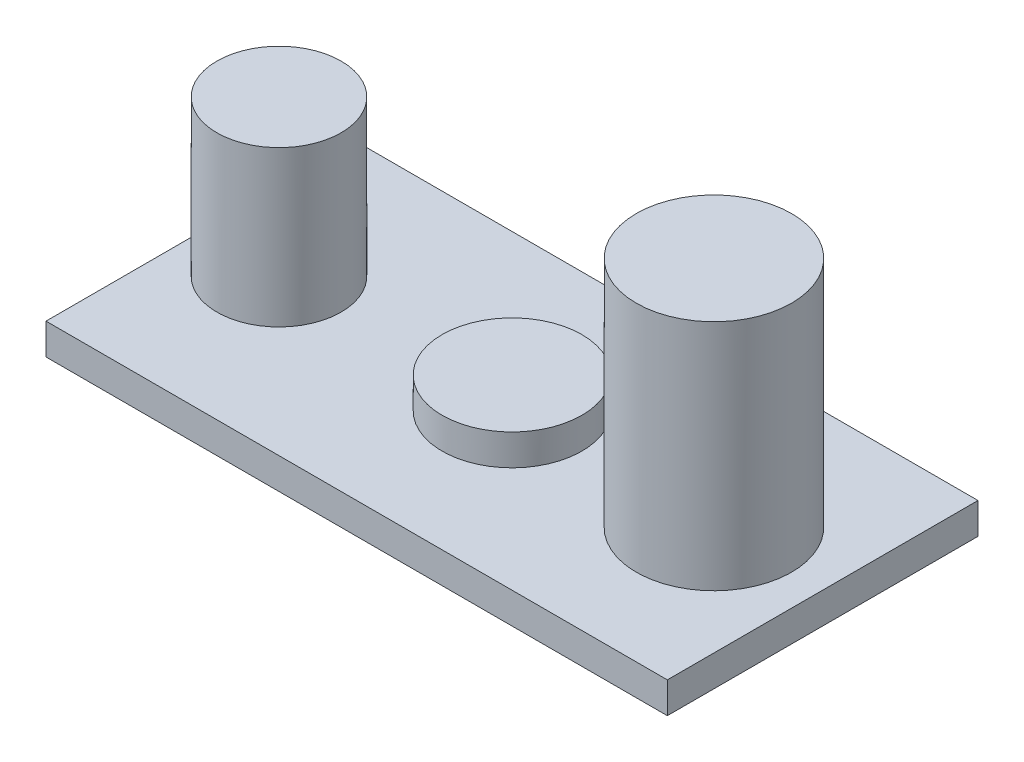
ISO-10303-21;
HEADER;
FILE_DESCRIPTION(('STEP AP214'),'2;1');
FILE_NAME('part.step','',(''),(''),'','','');
FILE_SCHEMA(('AUTOMOTIVE_DESIGN { 1 0 10303 214 1 1 1 1 }'));
ENDSEC;
DATA;
#1=APPLICATION_CONTEXT('core data for automotive mechanical design processes');
#2=APPLICATION_PROTOCOL_DEFINITION('international standard','automotive_design',2000,#1);
#3=PRODUCT_CONTEXT('',#1,'mechanical');
#4=PRODUCT('Part','Part','',(#3));
#5=PRODUCT_RELATED_PRODUCT_CATEGORY('part','',(#4));
#6=PRODUCT_DEFINITION_FORMATION('','',#4);
#7=PRODUCT_DEFINITION_CONTEXT('part definition',#1,'design');
#8=PRODUCT_DEFINITION('design','',#6,#7);
#9=PRODUCT_DEFINITION_SHAPE('','',#8);
#10=(LENGTH_UNIT() NAMED_UNIT(*) SI_UNIT(.MILLI.,.METRE.));
#11=(NAMED_UNIT(*) PLANE_ANGLE_UNIT() SI_UNIT($,.RADIAN.));
#12=(NAMED_UNIT(*) SI_UNIT($,.STERADIAN.) SOLID_ANGLE_UNIT());
#13=UNCERTAINTY_MEASURE_WITH_UNIT(LENGTH_MEASURE(1.E-05),#10,'distance_accuracy_value','');
#14=(GEOMETRIC_REPRESENTATION_CONTEXT(3) GLOBAL_UNCERTAINTY_ASSIGNED_CONTEXT((#13)) GLOBAL_UNIT_ASSIGNED_CONTEXT((#10,
#11,#12)) REPRESENTATION_CONTEXT('',''));
#15=CARTESIAN_POINT('',(0.,0.,0.));
#16=DIRECTION('',(0.,0.,1.));
#17=DIRECTION('',(1.,0.,0.));
#18=AXIS2_PLACEMENT_3D('',#15,#16,#17);
#19=CARTESIAN_POINT('',(0.,5.,0.));
#20=DIRECTION('',(1.,0.,0.));
#21=DIRECTION('',(0.,0.,-1.));
#22=AXIS2_PLACEMENT_3D('',#19,#20,#21);
#23=PLANE('',#22);
#24=DIRECTION('',(0.,0.,1.));
#25=VECTOR('',#24,1.);
#26=CARTESIAN_POINT('',(0.,0.,0.));
#27=LINE('',#26,#25);
#28=CARTESIAN_POINT('',(0.,0.,-50.));
#29=VERTEX_POINT('',#28);
#30=CARTESIAN_POINT('',(0.,0.,0.));
#31=VERTEX_POINT('',#30);
#32=EDGE_CURVE('E111',#29,#31,#27,.T.);
#33=ORIENTED_EDGE('',*,*,#32,.T.);
#34=DIRECTION('',(0.,-1.,0.));
#35=VECTOR('',#34,1.);
#36=CARTESIAN_POINT('',(0.,5.,0.));
#37=LINE('',#36,#35);
#38=CARTESIAN_POINT('',(0.,5.,0.));
#39=VERTEX_POINT('',#38);
#40=EDGE_CURVE('E100',#39,#31,#37,.T.);
#41=ORIENTED_EDGE('',*,*,#40,.F.);
#42=DIRECTION('',(0.,0.,1.));
#43=VECTOR('',#42,1.);
#44=CARTESIAN_POINT('',(0.,5.,0.));
#45=LINE('',#44,#43);
#46=CARTESIAN_POINT('',(0.,5.,-50.));
#47=VERTEX_POINT('',#46);
#48=EDGE_CURVE('E92',#47,#39,#45,.T.);
#49=ORIENTED_EDGE('',*,*,#48,.F.);
#50=DIRECTION('',(0.,-1.,0.));
#51=VECTOR('',#50,1.);
#52=CARTESIAN_POINT('',(0.,5.,-50.));
#53=LINE('',#52,#51);
#54=EDGE_CURVE('E107',#47,#29,#53,.T.);
#55=ORIENTED_EDGE('',*,*,#54,.T.);
#56=EDGE_LOOP('',(#33,#41,#49,#55));
#57=FACE_BOUND('',#56,.T.);
#58=ADVANCED_FACE('F39',(#57),#23,.F.);
#59=CARTESIAN_POINT('',(0.,5.,0.));
#60=DIRECTION('',(0.,0.,-1.));
#61=DIRECTION('',(-1.,0.,0.));
#62=AXIS2_PLACEMENT_3D('',#59,#60,#61);
#63=PLANE('',#62);
#64=DIRECTION('',(1.,0.,0.));
#65=VECTOR('',#64,1.);
#66=CARTESIAN_POINT('',(0.,0.,0.));
#67=LINE('',#66,#65);
#68=CARTESIAN_POINT('',(100.,0.,0.));
#69=VERTEX_POINT('',#68);
#70=EDGE_CURVE('E98',#31,#69,#67,.T.);
#71=ORIENTED_EDGE('',*,*,#70,.T.);
#72=DIRECTION('',(0.,-1.,0.));
#73=VECTOR('',#72,1.);
#74=CARTESIAN_POINT('',(100.,5.,0.));
#75=LINE('',#74,#73);
#76=CARTESIAN_POINT('',(100.,5.,0.));
#77=VERTEX_POINT('',#76);
#78=EDGE_CURVE('E96',#77,#69,#75,.T.);
#79=ORIENTED_EDGE('',*,*,#78,.F.);
#80=DIRECTION('',(1.,0.,0.));
#81=VECTOR('',#80,1.);
#82=CARTESIAN_POINT('',(0.,5.,0.));
#83=LINE('',#82,#81);
#84=EDGE_CURVE('E87',#39,#77,#83,.T.);
#85=ORIENTED_EDGE('',*,*,#84,.F.);
#86=ORIENTED_EDGE('',*,*,#40,.T.);
#87=EDGE_LOOP('',(#71,#79,#85,#86));
#88=FACE_BOUND('',#87,.T.);
#89=ADVANCED_FACE('F97',(#88),#63,.F.);
#90=CARTESIAN_POINT('',(100.,5.,0.));
#91=DIRECTION('',(-1.,0.,0.));
#92=DIRECTION('',(0.,0.,1.));
#93=AXIS2_PLACEMENT_3D('',#90,#91,#92);
#94=PLANE('',#93);
#95=DIRECTION('',(0.,0.,-1.));
#96=VECTOR('',#95,1.);
#97=CARTESIAN_POINT('',(100.,0.,0.));
#98=LINE('',#97,#96);
#99=CARTESIAN_POINT('',(100.,0.,-50.));
#100=VERTEX_POINT('',#99);
#101=EDGE_CURVE('E73',#69,#100,#98,.T.);
#102=ORIENTED_EDGE('',*,*,#101,.T.);
#103=DIRECTION('',(0.,-1.,0.));
#104=VECTOR('',#103,1.);
#105=CARTESIAN_POINT('',(100.,5.,-50.));
#106=LINE('',#105,#104);
#107=CARTESIAN_POINT('',(100.,5.,-50.));
#108=VERTEX_POINT('',#107);
#109=EDGE_CURVE('E101',#108,#100,#106,.T.);
#110=ORIENTED_EDGE('',*,*,#109,.F.);
#111=DIRECTION('',(0.,0.,-1.));
#112=VECTOR('',#111,1.);
#113=CARTESIAN_POINT('',(100.,5.,0.));
#114=LINE('',#113,#112);
#115=EDGE_CURVE('E90',#77,#108,#114,.T.);
#116=ORIENTED_EDGE('',*,*,#115,.F.);
#117=ORIENTED_EDGE('',*,*,#78,.T.);
#118=EDGE_LOOP('',(#102,#110,#116,#117));
#119=FACE_BOUND('',#118,.T.);
#120=ADVANCED_FACE('F103',(#119),#94,.F.);
#121=CARTESIAN_POINT('',(0.,5.,-50.));
#122=DIRECTION('',(0.,0.,1.));
#123=DIRECTION('',(1.,0.,0.));
#124=AXIS2_PLACEMENT_3D('',#121,#122,#123);
#125=PLANE('',#124);
#126=DIRECTION('',(-1.,0.,0.));
#127=VECTOR('',#126,1.);
#128=CARTESIAN_POINT('',(0.,0.,-50.));
#129=LINE('',#128,#127);
#130=EDGE_CURVE('E79',#100,#29,#129,.T.);
#131=ORIENTED_EDGE('',*,*,#130,.T.);
#132=ORIENTED_EDGE('',*,*,#54,.F.);
#133=DIRECTION('',(-1.,0.,0.));
#134=VECTOR('',#133,1.);
#135=CARTESIAN_POINT('',(0.,5.,-50.));
#136=LINE('',#135,#134);
#137=EDGE_CURVE('E56',#108,#47,#136,.T.);
#138=ORIENTED_EDGE('',*,*,#137,.F.);
#139=ORIENTED_EDGE('',*,*,#109,.T.);
#140=EDGE_LOOP('',(#131,#132,#138,#139));
#141=FACE_BOUND('',#140,.T.);
#142=ADVANCED_FACE('F140',(#141),#125,.F.);
#143=CARTESIAN_POINT('',(0.,5.,0.));
#144=DIRECTION('',(0.,-1.,0.));
#145=DIRECTION('',(0.,0.,-1.));
#146=AXIS2_PLACEMENT_3D('',#143,#144,#145);
#147=PLANE('',#146);
#148=CARTESIAN_POINT('',(82.5,5.,-25.));
#149=DIRECTION('',(0.,-1.,0.));
#150=DIRECTION('',(0.,0.,-1.));
#151=AXIS2_PLACEMENT_3D('',#148,#149,#150);
#152=CIRCLE('',#151,12.5);
#153=CARTESIAN_POINT('',(82.5,5.,-37.5));
#154=VERTEX_POINT('',#153);
#155=EDGE_CURVE('E11',#154,#154,#152,.F.);
#156=ORIENTED_EDGE('',*,*,#155,.F.);
#157=EDGE_LOOP('',(#156));
#158=FACE_BOUND('',#157,.T.);
#159=CARTESIAN_POINT('',(50.,5.,-25.));
#160=DIRECTION('',(0.,-1.,0.));
#161=DIRECTION('',(0.,0.,-1.));
#162=AXIS2_PLACEMENT_3D('',#159,#160,#161);
#163=CIRCLE('',#162,11.25);
#164=CARTESIAN_POINT('',(50.,5.,-36.25));
#165=VERTEX_POINT('',#164);
#166=EDGE_CURVE('E48',#165,#165,#163,.F.);
#167=ORIENTED_EDGE('',*,*,#166,.F.);
#168=EDGE_LOOP('',(#167));
#169=FACE_BOUND('',#168,.T.);
#170=CARTESIAN_POINT('',(12.5,5.,-25.));
#171=DIRECTION('',(0.,-1.,0.));
#172=DIRECTION('',(0.,0.,-1.));
#173=AXIS2_PLACEMENT_3D('',#170,#171,#172);
#174=CIRCLE('',#173,10.);
#175=CARTESIAN_POINT('',(12.5,5.,-35.));
#176=VERTEX_POINT('',#175);
#177=EDGE_CURVE('E128',#176,#176,#174,.F.);
#178=ORIENTED_EDGE('',*,*,#177,.F.);
#179=EDGE_LOOP('',(#178));
#180=FACE_BOUND('',#179,.T.);
#181=ORIENTED_EDGE('',*,*,#48,.T.);
#182=ORIENTED_EDGE('',*,*,#84,.T.);
#183=ORIENTED_EDGE('',*,*,#115,.T.);
#184=ORIENTED_EDGE('',*,*,#137,.T.);
#185=EDGE_LOOP('',(#181,#182,#183,#184));
#186=FACE_BOUND('',#185,.T.);
#187=ADVANCED_FACE('F88',(#158,#169,#180,#186),#147,.F.);
#188=CARTESIAN_POINT('',(0.,0.,0.));
#189=DIRECTION('',(0.,-1.,0.));
#190=DIRECTION('',(0.,0.,-1.));
#191=AXIS2_PLACEMENT_3D('',#188,#189,#190);
#192=PLANE('',#191);
#193=ORIENTED_EDGE('',*,*,#32,.F.);
#194=ORIENTED_EDGE('',*,*,#130,.F.);
#195=ORIENTED_EDGE('',*,*,#101,.F.);
#196=ORIENTED_EDGE('',*,*,#70,.F.);
#197=EDGE_LOOP('',(#193,#194,#195,#196));
#198=FACE_BOUND('',#197,.T.);
#199=ADVANCED_FACE('F139',(#198),#192,.T.);
#200=CARTESIAN_POINT('',(12.5,30.,-25.));
#201=DIRECTION('',(0.,-1.,0.));
#202=DIRECTION('',(0.,0.,-1.));
#203=AXIS2_PLACEMENT_3D('',#200,#201,#202);
#204=CYLINDRICAL_SURFACE('',#203,10.);
#205=CARTESIAN_POINT('',(12.5,30.,-25.));
#206=DIRECTION('',(0.,1.,0.));
#207=DIRECTION('',(0.,0.,1.));
#208=AXIS2_PLACEMENT_3D('',#205,#206,#207);
#209=CIRCLE('',#208,10.);
#210=CARTESIAN_POINT('',(12.5,30.,-15.));
#211=VERTEX_POINT('',#210);
#212=EDGE_CURVE('E115',#211,#211,#209,.T.);
#213=ORIENTED_EDGE('',*,*,#212,.F.);
#214=EDGE_LOOP('',(#213));
#215=FACE_BOUND('',#214,.T.);
#216=ORIENTED_EDGE('',*,*,#177,.T.);
#217=EDGE_LOOP('',(#216));
#218=FACE_BOUND('',#217,.T.);
#219=ADVANCED_FACE('F145',(#215,#218),#204,.T.);
#220=CARTESIAN_POINT('',(12.5,30.,-25.));
#221=DIRECTION('',(0.,1.,0.));
#222=DIRECTION('',(0.,0.,1.));
#223=AXIS2_PLACEMENT_3D('',#220,#221,#222);
#224=PLANE('',#223);
#225=ORIENTED_EDGE('',*,*,#212,.T.);
#226=EDGE_LOOP('',(#225));
#227=FACE_BOUND('',#226,.T.);
#228=ADVANCED_FACE('F147',(#227),#224,.T.);
#229=CARTESIAN_POINT('',(50.,10.,-25.));
#230=DIRECTION('',(0.,-1.,0.));
#231=DIRECTION('',(0.,0.,-1.));
#232=AXIS2_PLACEMENT_3D('',#229,#230,#231);
#233=CYLINDRICAL_SURFACE('',#232,11.25);
#234=CARTESIAN_POINT('',(50.,10.,-25.));
#235=DIRECTION('',(0.,1.,0.));
#236=DIRECTION('',(0.,0.,1.));
#237=AXIS2_PLACEMENT_3D('',#234,#235,#236);
#238=CIRCLE('',#237,11.25);
#239=CARTESIAN_POINT('',(50.,10.,-13.75));
#240=VERTEX_POINT('',#239);
#241=EDGE_CURVE('E254',#240,#240,#238,.T.);
#242=ORIENTED_EDGE('',*,*,#241,.F.);
#243=EDGE_LOOP('',(#242));
#244=FACE_BOUND('',#243,.T.);
#245=ORIENTED_EDGE('',*,*,#166,.T.);
#246=EDGE_LOOP('',(#245));
#247=FACE_BOUND('',#246,.T.);
#248=ADVANCED_FACE('F135',(#244,#247),#233,.T.);
#249=CARTESIAN_POINT('',(50.,10.,-25.));
#250=DIRECTION('',(0.,1.,0.));
#251=DIRECTION('',(0.,0.,1.));
#252=AXIS2_PLACEMENT_3D('',#249,#250,#251);
#253=PLANE('',#252);
#254=ORIENTED_EDGE('',*,*,#241,.T.);
#255=EDGE_LOOP('',(#254));
#256=FACE_BOUND('',#255,.T.);
#257=ADVANCED_FACE('F218',(#256),#253,.T.);
#258=CARTESIAN_POINT('',(82.5,42.5,-25.));
#259=DIRECTION('',(0.,-1.,0.));
#260=DIRECTION('',(0.,0.,-1.));
#261=AXIS2_PLACEMENT_3D('',#258,#259,#260);
#262=CYLINDRICAL_SURFACE('',#261,12.5);
#263=CARTESIAN_POINT('',(82.5,42.5,-25.));
#264=DIRECTION('',(0.,1.,0.));
#265=DIRECTION('',(0.,0.,1.));
#266=AXIS2_PLACEMENT_3D('',#263,#264,#265);
#267=CIRCLE('',#266,12.5);
#268=CARTESIAN_POINT('',(82.5,42.5,-12.5));
#269=VERTEX_POINT('',#268);
#270=EDGE_CURVE('E252',#269,#269,#267,.T.);
#271=ORIENTED_EDGE('',*,*,#270,.F.);
#272=EDGE_LOOP('',(#271));
#273=FACE_BOUND('',#272,.T.);
#274=ORIENTED_EDGE('',*,*,#155,.T.);
#275=EDGE_LOOP('',(#274));
#276=FACE_BOUND('',#275,.T.);
#277=ADVANCED_FACE('F226',(#273,#276),#262,.T.);
#278=CARTESIAN_POINT('',(82.5,42.5,-25.));
#279=DIRECTION('',(0.,1.,0.));
#280=DIRECTION('',(0.,0.,1.));
#281=AXIS2_PLACEMENT_3D('',#278,#279,#280);
#282=PLANE('',#281);
#283=ORIENTED_EDGE('',*,*,#270,.T.);
#284=EDGE_LOOP('',(#283));
#285=FACE_BOUND('',#284,.T.);
#286=ADVANCED_FACE('F234',(#285),#282,.T.);
#287=CLOSED_SHELL('',(#58,#89,#120,#142,#187,#199,#219,#228,#248,#257,#277,#286));
#288=MANIFOLD_SOLID_BREP('B2',#287);
#289=ADVANCED_BREP_SHAPE_REPRESENTATION('',(#18,#288),#14);
#290=SHAPE_DEFINITION_REPRESENTATION(#9,#289);
ENDSEC;
END-ISO-10303-21;
